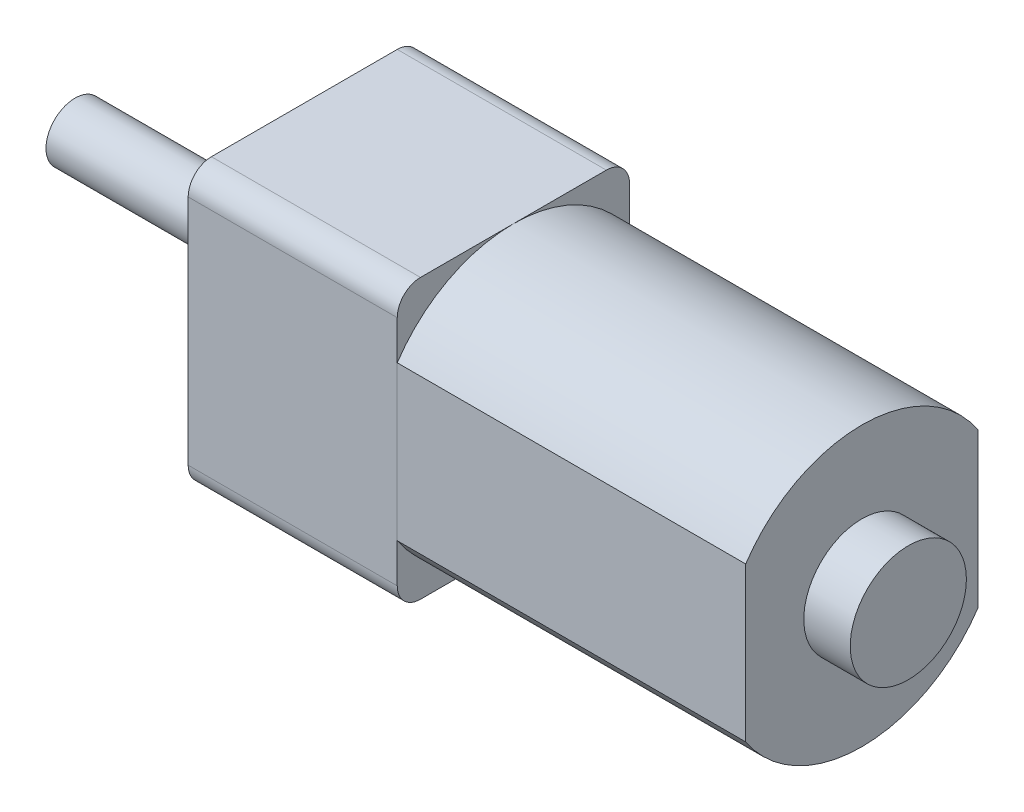
ISO-10303-21;
HEADER;
FILE_DESCRIPTION(('STEP AP214'),'2;1');
FILE_NAME('part.step','',(''),(''),'','','');
FILE_SCHEMA(('AUTOMOTIVE_DESIGN { 1 0 10303 214 1 1 1 1 }'));
ENDSEC;
DATA;
#1=APPLICATION_CONTEXT('core data for automotive mechanical design processes');
#2=APPLICATION_PROTOCOL_DEFINITION('international standard','automotive_design',2000,#1);
#3=PRODUCT_CONTEXT('',#1,'mechanical');
#4=PRODUCT('Part','Part','',(#3));
#5=PRODUCT_RELATED_PRODUCT_CATEGORY('part','',(#4));
#6=PRODUCT_DEFINITION_FORMATION('','',#4);
#7=PRODUCT_DEFINITION_CONTEXT('part definition',#1,'design');
#8=PRODUCT_DEFINITION('design','',#6,#7);
#9=PRODUCT_DEFINITION_SHAPE('','',#8);
#10=(LENGTH_UNIT() NAMED_UNIT(*) SI_UNIT(.MILLI.,.METRE.));
#11=(NAMED_UNIT(*) PLANE_ANGLE_UNIT() SI_UNIT($,.RADIAN.));
#12=(NAMED_UNIT(*) SI_UNIT($,.STERADIAN.) SOLID_ANGLE_UNIT());
#13=UNCERTAINTY_MEASURE_WITH_UNIT(LENGTH_MEASURE(1.E-05),#10,'distance_accuracy_value','');
#14=(GEOMETRIC_REPRESENTATION_CONTEXT(3) GLOBAL_UNCERTAINTY_ASSIGNED_CONTEXT((#13)) GLOBAL_UNIT_ASSIGNED_CONTEXT((#10,
#11,#12)) REPRESENTATION_CONTEXT('',''));
#15=CARTESIAN_POINT('',(0.,0.,0.));
#16=DIRECTION('',(0.,0.,1.));
#17=DIRECTION('',(1.,0.,0.));
#18=AXIS2_PLACEMENT_3D('',#15,#16,#17);
#19=CARTESIAN_POINT('',(-24.6,0.,0.));
#20=DIRECTION('',(-1.,0.,0.));
#21=DIRECTION('',(0.,0.,1.));
#22=AXIS2_PLACEMENT_3D('',#19,#20,#21);
#23=PLANE('',#22);
#24=CARTESIAN_POINT('',(-24.6,0.,0.));
#25=DIRECTION('',(-1.,0.,0.));
#26=DIRECTION('',(0.,0.,1.));
#27=AXIS2_PLACEMENT_3D('',#24,#25,#26);
#28=CIRCLE('',#27,1.95);
#29=CARTESIAN_POINT('',(-24.6,0.,1.95000000000001));
#30=VERTEX_POINT('',#29);
#31=EDGE_CURVE('E11',#30,#30,#28,.T.);
#32=ORIENTED_EDGE('',*,*,#31,.T.);
#33=EDGE_LOOP('',(#32));
#34=FACE_BOUND('',#33,.T.);
#35=CARTESIAN_POINT('',(-24.6,0.,0.));
#36=DIRECTION('',(-1.,0.,0.));
#37=DIRECTION('',(0.,0.,1.));
#38=AXIS2_PLACEMENT_3D('',#35,#36,#37);
#39=CIRCLE('',#38,1.25);
#40=CARTESIAN_POINT('',(-24.6,0.,1.25000000000001));
#41=VERTEX_POINT('',#40);
#42=EDGE_CURVE('E56',#41,#41,#39,.T.);
#43=ORIENTED_EDGE('',*,*,#42,.F.);
#44=EDGE_LOOP('',(#43));
#45=FACE_BOUND('',#44,.T.);
#46=ADVANCED_FACE('F43',(#34,#45),#23,.T.);
#47=CARTESIAN_POINT('',(-24.6,0.,0.));
#48=DIRECTION('',(1.,0.,0.));
#49=DIRECTION('',(0.,0.,-1.));
#50=AXIS2_PLACEMENT_3D('',#47,#48,#49);
#51=CYLINDRICAL_SURFACE('',#50,1.95);
#52=ORIENTED_EDGE('',*,*,#31,.F.);
#53=EDGE_LOOP('',(#52));
#54=FACE_BOUND('',#53,.T.);
#55=CARTESIAN_POINT('',(-24.,0.,0.));
#56=DIRECTION('',(-1.,0.,0.));
#57=DIRECTION('',(0.,0.,1.));
#58=AXIS2_PLACEMENT_3D('',#55,#56,#57);
#59=CIRCLE('',#58,1.95);
#60=CARTESIAN_POINT('',(-24.,0.,1.95));
#61=VERTEX_POINT('',#60);
#62=EDGE_CURVE('E47',#61,#61,#59,.T.);
#63=ORIENTED_EDGE('',*,*,#62,.T.);
#64=EDGE_LOOP('',(#63));
#65=FACE_BOUND('',#64,.T.);
#66=ADVANCED_FACE('F45',(#54,#65),#51,.T.);
#67=CARTESIAN_POINT('',(-24.,0.,0.));
#68=DIRECTION('',(-1.,0.,0.));
#69=DIRECTION('',(0.,0.,1.));
#70=AXIS2_PLACEMENT_3D('',#67,#68,#69);
#71=PLANE('',#70);
#72=ORIENTED_EDGE('',*,*,#62,.F.);
#73=EDGE_LOOP('',(#72));
#74=FACE_BOUND('',#73,.T.);
#75=ADVANCED_FACE('F67',(#74),#71,.F.);
#76=CARTESIAN_POINT('',(-33.87,0.,0.));
#77=DIRECTION('',(1.,0.,0.));
#78=DIRECTION('',(0.,0.,-1.));
#79=AXIS2_PLACEMENT_3D('',#76,#77,#78);
#80=CYLINDRICAL_SURFACE('',#79,1.25);
#81=CARTESIAN_POINT('',(-33.87,0.,0.));
#82=DIRECTION('',(-1.,0.,0.));
#83=DIRECTION('',(0.,0.,1.));
#84=AXIS2_PLACEMENT_3D('',#81,#82,#83);
#85=CIRCLE('',#84,1.25);
#86=CARTESIAN_POINT('',(-33.87,0.,1.25000000000001));
#87=VERTEX_POINT('',#86);
#88=EDGE_CURVE('E54',#87,#87,#85,.T.);
#89=ORIENTED_EDGE('',*,*,#88,.F.);
#90=EDGE_LOOP('',(#89));
#91=FACE_BOUND('',#90,.T.);
#92=ORIENTED_EDGE('',*,*,#42,.T.);
#93=EDGE_LOOP('',(#92));
#94=FACE_BOUND('',#93,.T.);
#95=ADVANCED_FACE('F64',(#91,#94),#80,.T.);
#96=CARTESIAN_POINT('',(-33.87,0.,0.));
#97=DIRECTION('',(-1.,0.,0.));
#98=DIRECTION('',(0.,0.,1.));
#99=AXIS2_PLACEMENT_3D('',#96,#97,#98);
#100=PLANE('',#99);
#101=ORIENTED_EDGE('',*,*,#88,.T.);
#102=EDGE_LOOP('',(#101));
#103=FACE_BOUND('',#102,.T.);
#104=ADVANCED_FACE('F62',(#103),#100,.T.);
#105=CLOSED_SHELL('',(#46,#66,#75,#95,#104));
#106=MANIFOLD_SOLID_BREP('B2',#105);
#107=CARTESIAN_POINT('',(2.00000000000001,0.,0.));
#108=DIRECTION('',(-1.,0.,0.));
#109=DIRECTION('',(0.,0.,1.));
#110=AXIS2_PLACEMENT_3D('',#107,#108,#109);
#111=CYLINDRICAL_SURFACE('',#110,2.5);
#112=CARTESIAN_POINT('',(2.00000000000001,0.,0.));
#113=DIRECTION('',(1.,0.,0.));
#114=DIRECTION('',(0.,0.,-1.));
#115=AXIS2_PLACEMENT_3D('',#112,#113,#114);
#116=CIRCLE('',#115,2.5);
#117=CARTESIAN_POINT('',(2.00000000000001,0.,-2.50000000000001));
#118=VERTEX_POINT('',#117);
#119=EDGE_CURVE('E42',#118,#118,#116,.T.);
#120=ORIENTED_EDGE('',*,*,#119,.F.);
#121=EDGE_LOOP('',(#120));
#122=FACE_BOUND('',#121,.T.);
#123=CARTESIAN_POINT('',(0.,0.,0.));
#124=DIRECTION('',(1.,0.,0.));
#125=DIRECTION('',(0.,0.,-1.));
#126=AXIS2_PLACEMENT_3D('',#123,#124,#125);
#127=CIRCLE('',#126,2.5);
#128=CARTESIAN_POINT('',(0.,0.,-2.50000000000001));
#129=VERTEX_POINT('',#128);
#130=EDGE_CURVE('E126',#129,#129,#127,.T.);
#131=ORIENTED_EDGE('',*,*,#130,.T.);
#132=EDGE_LOOP('',(#131));
#133=FACE_BOUND('',#132,.T.);
#134=ADVANCED_FACE('F123',(#122,#133),#111,.T.);
#135=CARTESIAN_POINT('',(2.00000000000001,0.,0.));
#136=DIRECTION('',(1.,0.,0.));
#137=DIRECTION('',(0.,0.,-1.));
#138=AXIS2_PLACEMENT_3D('',#135,#136,#137);
#139=PLANE('',#138);
#140=ORIENTED_EDGE('',*,*,#119,.T.);
#141=EDGE_LOOP('',(#140));
#142=FACE_BOUND('',#141,.T.);
#143=ADVANCED_FACE('F138',(#142),#139,.T.);
#144=CARTESIAN_POINT('',(0.,0.,0.));
#145=DIRECTION('',(1.,0.,0.));
#146=DIRECTION('',(0.,0.,-1.));
#147=AXIS2_PLACEMENT_3D('',#144,#145,#146);
#148=PLANE('',#147);
#149=ORIENTED_EDGE('',*,*,#130,.F.);
#150=EDGE_LOOP('',(#149));
#151=FACE_BOUND('',#150,.T.);
#152=ADVANCED_FACE('F136',(#151),#148,.F.);
#153=CLOSED_SHELL('',(#134,#143,#152));
#154=MANIFOLD_SOLID_BREP('B6',#153);
#155=CARTESIAN_POINT('',(-24.,6.00000000000001,5.));
#156=DIRECTION('',(1.,0.,0.));
#157=DIRECTION('',(0.,0.,-1.));
#158=AXIS2_PLACEMENT_3D('',#155,#156,#157);
#159=PLANE('',#158);
#160=DIRECTION('',(0.,-1.,0.));
#161=VECTOR('',#160,1.);
#162=CARTESIAN_POINT('',(-24.,-6.00000000000009,-5.00000000000001));
#163=LINE('',#162,#161);
#164=CARTESIAN_POINT('',(-24.,5.00000000000003,-5.00000000000002));
#165=VERTEX_POINT('',#164);
#166=CARTESIAN_POINT('',(-24.,-5.00000000000009,-5.00000000000002));
#167=VERTEX_POINT('',#166);
#168=EDGE_CURVE('E303',#165,#167,#163,.T.);
#169=ORIENTED_EDGE('',*,*,#168,.T.);
#170=CARTESIAN_POINT('',(-24.,-5.00000000000009,-4.00000000000001));
#171=DIRECTION('',(1.,0.,0.));
#172=DIRECTION('',(0.,0.,-1.));
#173=AXIS2_PLACEMENT_3D('',#170,#171,#172);
#174=CIRCLE('',#173,1.);
#175=CARTESIAN_POINT('',(-24.,-6.00000000000009,-4.00000000000001));
#176=VERTEX_POINT('',#175);
#177=EDGE_CURVE('E286',#167,#176,#174,.F.);
#178=ORIENTED_EDGE('',*,*,#177,.T.);
#179=DIRECTION('',(0.,0.,1.));
#180=VECTOR('',#179,1.);
#181=CARTESIAN_POINT('',(-24.,-6.00000000000009,-5.00000000000001));
#182=LINE('',#181,#180);
#183=CARTESIAN_POINT('',(-24.,-6.00000000000004,4.00000000000002));
#184=VERTEX_POINT('',#183);
#185=EDGE_CURVE('E257',#176,#184,#182,.T.);
#186=ORIENTED_EDGE('',*,*,#185,.T.);
#187=CARTESIAN_POINT('',(-24.,-5.00000000000004,4.00000000000002));
#188=DIRECTION('',(1.,0.,0.));
#189=DIRECTION('',(0.,0.,-1.));
#190=AXIS2_PLACEMENT_3D('',#187,#188,#189);
#191=CIRCLE('',#190,1.);
#192=CARTESIAN_POINT('',(-24.,-5.00000000000004,5.00000000000002));
#193=VERTEX_POINT('',#192);
#194=EDGE_CURVE('E284',#184,#193,#191,.F.);
#195=ORIENTED_EDGE('',*,*,#194,.T.);
#196=DIRECTION('',(0.,1.,0.));
#197=VECTOR('',#196,1.);
#198=CARTESIAN_POINT('',(-24.,-6.00000000000004,5.00000000000002));
#199=LINE('',#198,#197);
#200=CARTESIAN_POINT('',(-24.,4.99999999999999,5.));
#201=VERTEX_POINT('',#200);
#202=EDGE_CURVE('E264',#193,#201,#199,.T.);
#203=ORIENTED_EDGE('',*,*,#202,.T.);
#204=CARTESIAN_POINT('',(-24.,4.99999999999999,4.));
#205=DIRECTION('',(1.,0.,0.));
#206=DIRECTION('',(0.,0.,-1.));
#207=AXIS2_PLACEMENT_3D('',#204,#205,#206);
#208=CIRCLE('',#207,1.);
#209=CARTESIAN_POINT('',(-24.,6.00000000000001,4.));
#210=VERTEX_POINT('',#209);
#211=EDGE_CURVE('E192',#201,#210,#208,.F.);
#212=ORIENTED_EDGE('',*,*,#211,.T.);
#213=DIRECTION('',(0.,0.,-1.));
#214=VECTOR('',#213,1.);
#215=CARTESIAN_POINT('',(-24.,6.00000000000003,-5.00000000000002));
#216=LINE('',#215,#214);
#217=CARTESIAN_POINT('',(-24.,6.00000000000003,-4.00000000000002));
#218=VERTEX_POINT('',#217);
#219=EDGE_CURVE('E267',#210,#218,#216,.T.);
#220=ORIENTED_EDGE('',*,*,#219,.T.);
#221=CARTESIAN_POINT('',(-24.,5.00000000000003,-4.00000000000001));
#222=DIRECTION('',(1.,0.,0.));
#223=DIRECTION('',(0.,0.,-1.));
#224=AXIS2_PLACEMENT_3D('',#221,#222,#223);
#225=CIRCLE('',#224,1.);
#226=EDGE_CURVE('E282',#218,#165,#225,.F.);
#227=ORIENTED_EDGE('',*,*,#226,.T.);
#228=EDGE_LOOP('',(#169,#178,#186,#195,#203,#212,#220,#227));
#229=FACE_BOUND('',#228,.T.);
#230=CARTESIAN_POINT('',(-24.,0.,0.));
#231=DIRECTION('',(-1.,0.,0.));
#232=DIRECTION('',(0.,0.,1.));
#233=AXIS2_PLACEMENT_3D('',#230,#231,#232);
#234=CIRCLE('',#233,1.40454739751599);
#235=CARTESIAN_POINT('',(-24.,0.,1.40454739751599));
#236=VERTEX_POINT('',#235);
#237=EDGE_CURVE('E299',#236,#236,#234,.T.);
#238=ORIENTED_EDGE('',*,*,#237,.F.);
#239=EDGE_LOOP('',(#238));
#240=FACE_BOUND('',#239,.T.);
#241=ADVANCED_FACE('F172',(#229,#240),#159,.F.);
#242=CARTESIAN_POINT('',(-15.,5.99999999999996,5.00000000000002));
#243=DIRECTION('',(1.,0.,0.));
#244=DIRECTION('',(0.,0.,-1.));
#245=AXIS2_PLACEMENT_3D('',#242,#243,#244);
#246=PLANE('',#245);
#247=DIRECTION('',(0.,0.,1.));
#248=VECTOR('',#247,1.);
#249=CARTESIAN_POINT('',(-15.,-6.00000000000012,-5.00000000000002));
#250=LINE('',#249,#248);
#251=CARTESIAN_POINT('',(-15.,-6.00000000000012,-4.00000000000001));
#252=VERTEX_POINT('',#251);
#253=CARTESIAN_POINT('',(-15.,-6.00000000000008,4.00000000000002));
#254=VERTEX_POINT('',#253);
#255=EDGE_CURVE('E254',#252,#254,#250,.T.);
#256=ORIENTED_EDGE('',*,*,#255,.F.);
#257=CARTESIAN_POINT('',(-15.,-5.00000000000008,-4.00000000000001));
#258=DIRECTION('',(1.,0.,0.));
#259=DIRECTION('',(0.,0.,-1.));
#260=AXIS2_PLACEMENT_3D('',#257,#258,#259);
#261=CIRCLE('',#260,1.);
#262=CARTESIAN_POINT('',(-15.,-5.00000000000008,-5.00000000000003));
#263=VERTEX_POINT('',#262);
#264=EDGE_CURVE('E237',#252,#263,#261,.T.);
#265=ORIENTED_EDGE('',*,*,#264,.T.);
#266=DIRECTION('',(0.,-1.,0.));
#267=VECTOR('',#266,1.);
#268=CARTESIAN_POINT('',(-15.,-6.00000000000012,-5.00000000000002));
#269=LINE('',#268,#267);
#270=CARTESIAN_POINT('',(-15.,4.99999999999992,-5.00000000000003));
#271=VERTEX_POINT('',#270);
#272=EDGE_CURVE('E265',#271,#263,#269,.T.);
#273=ORIENTED_EDGE('',*,*,#272,.F.);
#274=CARTESIAN_POINT('',(-15.,4.99999999999992,-4.00000000000001));
#275=DIRECTION('',(1.,0.,0.));
#276=DIRECTION('',(0.,0.,-1.));
#277=AXIS2_PLACEMENT_3D('',#274,#275,#276);
#278=CIRCLE('',#277,1.);
#279=CARTESIAN_POINT('',(-15.,5.99999999999996,-4.00000000000002));
#280=VERTEX_POINT('',#279);
#281=EDGE_CURVE('E275',#271,#280,#278,.T.);
#282=ORIENTED_EDGE('',*,*,#281,.T.);
#283=DIRECTION('',(0.,0.,-1.));
#284=VECTOR('',#283,1.);
#285=CARTESIAN_POINT('',(-15.,5.99999999999996,-5.00000000000003));
#286=LINE('',#285,#284);
#287=CARTESIAN_POINT('',(-15.,5.99999999999996,4.));
#288=VERTEX_POINT('',#287);
#289=EDGE_CURVE('E269',#288,#280,#286,.T.);
#290=ORIENTED_EDGE('',*,*,#289,.F.);
#291=CARTESIAN_POINT('',(-15.,4.99999999999996,4.));
#292=DIRECTION('',(1.,0.,0.));
#293=DIRECTION('',(0.,0.,-1.));
#294=AXIS2_PLACEMENT_3D('',#291,#292,#293);
#295=CIRCLE('',#294,1.);
#296=CARTESIAN_POINT('',(-15.,4.99999999999996,5.00000000000002));
#297=VERTEX_POINT('',#296);
#298=EDGE_CURVE('E258',#288,#297,#295,.T.);
#299=ORIENTED_EDGE('',*,*,#298,.T.);
#300=DIRECTION('',(0.,1.,0.));
#301=VECTOR('',#300,1.);
#302=CARTESIAN_POINT('',(-15.,-6.00000000000008,5.00000000000004));
#303=LINE('',#302,#301);
#304=CARTESIAN_POINT('',(-15.,-5.00000000000008,5.00000000000004));
#305=VERTEX_POINT('',#304);
#306=EDGE_CURVE('E298',#305,#297,#303,.T.);
#307=ORIENTED_EDGE('',*,*,#306,.F.);
#308=CARTESIAN_POINT('',(-15.,-5.00000000000008,4.00000000000002));
#309=DIRECTION('',(1.,0.,0.));
#310=DIRECTION('',(0.,0.,-1.));
#311=AXIS2_PLACEMENT_3D('',#308,#309,#310);
#312=CIRCLE('',#311,1.);
#313=EDGE_CURVE('E248',#305,#254,#312,.T.);
#314=ORIENTED_EDGE('',*,*,#313,.T.);
#315=EDGE_LOOP('',(#256,#265,#273,#282,#290,#299,#307,#314));
#316=FACE_BOUND('',#315,.T.);
#317=CARTESIAN_POINT('',(-15.,0.,0.));
#318=DIRECTION('',(-1.,0.,0.));
#319=DIRECTION('',(0.,0.,1.));
#320=AXIS2_PLACEMENT_3D('',#317,#318,#319);
#321=CIRCLE('',#320,1.40454739751599);
#322=CARTESIAN_POINT('',(-15.,0.,1.40454739751599));
#323=VERTEX_POINT('',#322);
#324=EDGE_CURVE('E307',#323,#323,#321,.T.);
#325=ORIENTED_EDGE('',*,*,#324,.T.);
#326=EDGE_LOOP('',(#325));
#327=FACE_BOUND('',#326,.T.);
#328=ADVANCED_FACE('F261',(#316,#327),#246,.T.);
#329=CARTESIAN_POINT('',(-24.,-6.00000000000004,5.00000000000002));
#330=DIRECTION('',(0.,0.,-1.));
#331=DIRECTION('',(-1.,0.,0.));
#332=AXIS2_PLACEMENT_3D('',#329,#330,#331);
#333=PLANE('',#332);
#334=ORIENTED_EDGE('',*,*,#202,.F.);
#335=DIRECTION('',(1.,0.,0.));
#336=VECTOR('',#335,1.);
#337=CARTESIAN_POINT('',(-24.,-5.00000000000004,5.00000000000002));
#338=LINE('',#337,#336);
#339=EDGE_CURVE('E290',#193,#305,#338,.T.);
#340=ORIENTED_EDGE('',*,*,#339,.T.);
#341=ORIENTED_EDGE('',*,*,#306,.T.);
#342=DIRECTION('',(1.,0.,0.));
#343=VECTOR('',#342,1.);
#344=CARTESIAN_POINT('',(-24.,4.99999999999999,5.));
#345=LINE('',#344,#343);
#346=EDGE_CURVE('E288',#297,#201,#345,.F.);
#347=ORIENTED_EDGE('',*,*,#346,.T.);
#348=EDGE_LOOP('',(#334,#340,#341,#347));
#349=FACE_BOUND('',#348,.T.);
#350=ADVANCED_FACE('F321',(#349),#333,.F.);
#351=CARTESIAN_POINT('',(-24.,6.00000000000003,-5.00000000000002));
#352=DIRECTION('',(0.,-1.,0.));
#353=DIRECTION('',(0.,0.,-1.));
#354=AXIS2_PLACEMENT_3D('',#351,#352,#353);
#355=PLANE('',#354);
#356=ORIENTED_EDGE('',*,*,#289,.T.);
#357=DIRECTION('',(1.,0.,0.));
#358=VECTOR('',#357,1.);
#359=CARTESIAN_POINT('',(-24.,6.00000000000003,-4.00000000000002));
#360=LINE('',#359,#358);
#361=EDGE_CURVE('E121',#280,#218,#360,.F.);
#362=ORIENTED_EDGE('',*,*,#361,.T.);
#363=ORIENTED_EDGE('',*,*,#219,.F.);
#364=DIRECTION('',(1.,0.,0.));
#365=VECTOR('',#364,1.);
#366=CARTESIAN_POINT('',(-24.,6.00000000000001,4.));
#367=LINE('',#366,#365);
#368=EDGE_CURVE('E180',#210,#288,#367,.T.);
#369=ORIENTED_EDGE('',*,*,#368,.T.);
#370=EDGE_LOOP('',(#356,#362,#363,#369));
#371=FACE_BOUND('',#370,.T.);
#372=ADVANCED_FACE('F295',(#371),#355,.F.);
#373=CARTESIAN_POINT('',(-24.,-6.00000000000009,-5.00000000000001));
#374=DIRECTION('',(0.,0.,1.));
#375=DIRECTION('',(1.,0.,0.));
#376=AXIS2_PLACEMENT_3D('',#373,#374,#375);
#377=PLANE('',#376);
#378=ORIENTED_EDGE('',*,*,#272,.T.);
#379=DIRECTION('',(1.,0.,0.));
#380=VECTOR('',#379,1.);
#381=CARTESIAN_POINT('',(-24.,-5.00000000000009,-5.00000000000002));
#382=LINE('',#381,#380);
#383=EDGE_CURVE('E242',#263,#167,#382,.F.);
#384=ORIENTED_EDGE('',*,*,#383,.T.);
#385=ORIENTED_EDGE('',*,*,#168,.F.);
#386=DIRECTION('',(1.,0.,0.));
#387=VECTOR('',#386,1.);
#388=CARTESIAN_POINT('',(-24.,5.00000000000003,-5.00000000000002));
#389=LINE('',#388,#387);
#390=EDGE_CURVE('E247',#165,#271,#389,.T.);
#391=ORIENTED_EDGE('',*,*,#390,.T.);
#392=EDGE_LOOP('',(#378,#384,#385,#391));
#393=FACE_BOUND('',#392,.T.);
#394=ADVANCED_FACE('F327',(#393),#377,.F.);
#395=CARTESIAN_POINT('',(-24.,-6.00000000000009,-5.00000000000001));
#396=DIRECTION('',(0.,1.,0.));
#397=DIRECTION('',(0.,0.,1.));
#398=AXIS2_PLACEMENT_3D('',#395,#396,#397);
#399=PLANE('',#398);
#400=ORIENTED_EDGE('',*,*,#185,.F.);
#401=DIRECTION('',(1.,0.,0.));
#402=VECTOR('',#401,1.);
#403=CARTESIAN_POINT('',(-24.,-6.00000000000009,-4.00000000000001));
#404=LINE('',#403,#402);
#405=EDGE_CURVE('E241',#176,#252,#404,.T.);
#406=ORIENTED_EDGE('',*,*,#405,.T.);
#407=ORIENTED_EDGE('',*,*,#255,.T.);
#408=DIRECTION('',(1.,0.,0.));
#409=VECTOR('',#408,1.);
#410=CARTESIAN_POINT('',(-24.,-6.00000000000004,4.00000000000002));
#411=LINE('',#410,#409);
#412=EDGE_CURVE('E259',#254,#184,#411,.F.);
#413=ORIENTED_EDGE('',*,*,#412,.T.);
#414=EDGE_LOOP('',(#400,#406,#407,#413));
#415=FACE_BOUND('',#414,.T.);
#416=ADVANCED_FACE('F253',(#415),#399,.F.);
#417=CARTESIAN_POINT('',(-24.,0.,0.));
#418=DIRECTION('',(1.,0.,0.));
#419=DIRECTION('',(0.,0.,-1.));
#420=AXIS2_PLACEMENT_3D('',#417,#418,#419);
#421=CYLINDRICAL_SURFACE('',#420,1.40454739751599);
#422=ORIENTED_EDGE('',*,*,#237,.T.);
#423=EDGE_LOOP('',(#422));
#424=FACE_BOUND('',#423,.T.);
#425=ORIENTED_EDGE('',*,*,#324,.F.);
#426=EDGE_LOOP('',(#425));
#427=FACE_BOUND('',#426,.T.);
#428=ADVANCED_FACE('F313',(#424,#427),#421,.F.);
#429=CARTESIAN_POINT('',(-24.,-5.00000000000009,-4.00000000000001));
#430=DIRECTION('',(1.,0.,0.));
#431=DIRECTION('',(0.,0.,-1.));
#432=AXIS2_PLACEMENT_3D('',#429,#430,#431);
#433=CYLINDRICAL_SURFACE('',#432,1.);
#434=ORIENTED_EDGE('',*,*,#177,.F.);
#435=ORIENTED_EDGE('',*,*,#383,.F.);
#436=ORIENTED_EDGE('',*,*,#264,.F.);
#437=ORIENTED_EDGE('',*,*,#405,.F.);
#438=EDGE_LOOP('',(#434,#435,#436,#437));
#439=FACE_BOUND('',#438,.T.);
#440=ADVANCED_FACE('F240',(#439),#433,.T.);
#441=CARTESIAN_POINT('',(-24.,-5.00000000000004,4.00000000000002));
#442=DIRECTION('',(1.,0.,0.));
#443=DIRECTION('',(0.,0.,-1.));
#444=AXIS2_PLACEMENT_3D('',#441,#442,#443);
#445=CYLINDRICAL_SURFACE('',#444,1.);
#446=ORIENTED_EDGE('',*,*,#194,.F.);
#447=ORIENTED_EDGE('',*,*,#412,.F.);
#448=ORIENTED_EDGE('',*,*,#313,.F.);
#449=ORIENTED_EDGE('',*,*,#339,.F.);
#450=EDGE_LOOP('',(#446,#447,#448,#449));
#451=FACE_BOUND('',#450,.T.);
#452=ADVANCED_FACE('F338',(#451),#445,.T.);
#453=CARTESIAN_POINT('',(-24.,5.00000000000003,-4.00000000000001));
#454=DIRECTION('',(1.,0.,0.));
#455=DIRECTION('',(0.,0.,-1.));
#456=AXIS2_PLACEMENT_3D('',#453,#454,#455);
#457=CYLINDRICAL_SURFACE('',#456,1.);
#458=ORIENTED_EDGE('',*,*,#226,.F.);
#459=ORIENTED_EDGE('',*,*,#361,.F.);
#460=ORIENTED_EDGE('',*,*,#281,.F.);
#461=ORIENTED_EDGE('',*,*,#390,.F.);
#462=EDGE_LOOP('',(#458,#459,#460,#461));
#463=FACE_BOUND('',#462,.T.);
#464=ADVANCED_FACE('F340',(#463),#457,.T.);
#465=CARTESIAN_POINT('',(-24.,4.99999999999999,4.));
#466=DIRECTION('',(1.,0.,0.));
#467=DIRECTION('',(0.,0.,-1.));
#468=AXIS2_PLACEMENT_3D('',#465,#466,#467);
#469=CYLINDRICAL_SURFACE('',#468,1.);
#470=ORIENTED_EDGE('',*,*,#211,.F.);
#471=ORIENTED_EDGE('',*,*,#346,.F.);
#472=ORIENTED_EDGE('',*,*,#298,.F.);
#473=ORIENTED_EDGE('',*,*,#368,.F.);
#474=EDGE_LOOP('',(#470,#471,#472,#473));
#475=FACE_BOUND('',#474,.T.);
#476=ADVANCED_FACE('F174',(#475),#469,.T.);
#477=CLOSED_SHELL('',(#241,#328,#350,#372,#394,#416,#428,#440,#452,#464,#476));
#478=MANIFOLD_SOLID_BREP('B37',#477);
#479=CARTESIAN_POINT('',(-15.,0.,0.));
#480=DIRECTION('',(1.,0.,0.));
#481=DIRECTION('',(0.,0.,-1.));
#482=AXIS2_PLACEMENT_3D('',#479,#480,#481);
#483=CYLINDRICAL_SURFACE('',#482,6.00000000000001);
#484=CARTESIAN_POINT('',(0.,0.,0.));
#485=DIRECTION('',(1.,0.,0.));
#486=DIRECTION('',(0.,0.,-1.));
#487=AXIS2_PLACEMENT_3D('',#484,#485,#486);
#488=CIRCLE('',#487,6.00000000000001);
#489=CARTESIAN_POINT('',(0.,3.31662479035535,-5.00000000000002));
#490=VERTEX_POINT('',#489);
#491=CARTESIAN_POINT('',(0.,3.3166247903554,5.));
#492=VERTEX_POINT('',#491);
#493=EDGE_CURVE('E484',#490,#492,#488,.T.);
#494=ORIENTED_EDGE('',*,*,#493,.F.);
#495=DIRECTION('',(1.,0.,0.));
#496=VECTOR('',#495,1.);
#497=CARTESIAN_POINT('',(-15.,3.31662479035537,-5.00000000000002));
#498=LINE('',#497,#496);
#499=CARTESIAN_POINT('',(-15.,3.31662479035537,-5.00000000000002));
#500=VERTEX_POINT('',#499);
#501=EDGE_CURVE('E170',#500,#490,#498,.T.);
#502=ORIENTED_EDGE('',*,*,#501,.F.);
#503=CARTESIAN_POINT('',(-15.,0.,0.));
#504=DIRECTION('',(1.,0.,0.));
#505=DIRECTION('',(0.,0.,-1.));
#506=AXIS2_PLACEMENT_3D('',#503,#504,#505);
#507=CIRCLE('',#506,6.00000000000001);
#508=CARTESIAN_POINT('',(-15.,3.31662479035537,5.));
#509=VERTEX_POINT('',#508);
#510=EDGE_CURVE('E478',#500,#509,#507,.T.);
#511=ORIENTED_EDGE('',*,*,#510,.T.);
#512=DIRECTION('',(1.,0.,0.));
#513=VECTOR('',#512,1.);
#514=CARTESIAN_POINT('',(-15.,3.31662479035537,5.));
#515=LINE('',#514,#513);
#516=EDGE_CURVE('E423',#509,#492,#515,.T.);
#517=ORIENTED_EDGE('',*,*,#516,.T.);
#518=EDGE_LOOP('',(#494,#502,#511,#517));
#519=FACE_BOUND('',#518,.T.);
#520=ADVANCED_FACE('F420',(#519),#483,.T.);
#521=CARTESIAN_POINT('',(-15.,3.31662479035537,-5.00000000000002));
#522=DIRECTION('',(0.,0.,-1.));
#523=DIRECTION('',(-1.,0.,0.));
#524=AXIS2_PLACEMENT_3D('',#521,#522,#523);
#525=PLANE('',#524);
#526=DIRECTION('',(0.,1.,0.));
#527=VECTOR('',#526,1.);
#528=CARTESIAN_POINT('',(0.,3.31662479035535,-5.00000000000002));
#529=LINE('',#528,#527);
#530=CARTESIAN_POINT('',(0.,-3.31662479035548,-5.00000000000004));
#531=VERTEX_POINT('',#530);
#532=EDGE_CURVE('E480',#531,#490,#529,.T.);
#533=ORIENTED_EDGE('',*,*,#532,.F.);
#534=DIRECTION('',(1.,0.,0.));
#535=VECTOR('',#534,1.);
#536=CARTESIAN_POINT('',(-15.,-3.31662479035554,-5.00000000000004));
#537=LINE('',#536,#535);
#538=CARTESIAN_POINT('',(-15.,-3.31662479035554,-5.00000000000004));
#539=VERTEX_POINT('',#538);
#540=EDGE_CURVE('E429',#539,#531,#537,.T.);
#541=ORIENTED_EDGE('',*,*,#540,.F.);
#542=DIRECTION('',(0.,1.,0.));
#543=VECTOR('',#542,1.);
#544=CARTESIAN_POINT('',(-15.,3.31662479035537,-5.00000000000002));
#545=LINE('',#544,#543);
#546=EDGE_CURVE('E475',#539,#500,#545,.T.);
#547=ORIENTED_EDGE('',*,*,#546,.T.);
#548=ORIENTED_EDGE('',*,*,#501,.T.);
#549=EDGE_LOOP('',(#533,#541,#547,#548));
#550=FACE_BOUND('',#549,.T.);
#551=ADVANCED_FACE('F494',(#550),#525,.T.);
#552=CARTESIAN_POINT('',(-15.,0.,0.));
#553=DIRECTION('',(1.,0.,0.));
#554=DIRECTION('',(0.,0.,-1.));
#555=AXIS2_PLACEMENT_3D('',#552,#553,#554);
#556=CYLINDRICAL_SURFACE('',#555,6.00000000000001);
#557=CARTESIAN_POINT('',(0.,0.,0.));
#558=DIRECTION('',(1.,0.,0.));
#559=DIRECTION('',(0.,0.,-1.));
#560=AXIS2_PLACEMENT_3D('',#557,#558,#559);
#561=CIRCLE('',#560,6.00000000000001);
#562=CARTESIAN_POINT('',(0.,-3.31662479035549,5.00000000000003));
#563=VERTEX_POINT('',#562);
#564=EDGE_CURVE('E470',#563,#531,#561,.T.);
#565=ORIENTED_EDGE('',*,*,#564,.F.);
#566=DIRECTION('',(1.,0.,0.));
#567=VECTOR('',#566,1.);
#568=CARTESIAN_POINT('',(-15.,-3.31662479035548,5.00000000000004));
#569=LINE('',#568,#567);
#570=CARTESIAN_POINT('',(-15.,-3.31662479035548,5.00000000000004));
#571=VERTEX_POINT('',#570);
#572=EDGE_CURVE('E465',#571,#563,#569,.T.);
#573=ORIENTED_EDGE('',*,*,#572,.F.);
#574=CARTESIAN_POINT('',(-15.,0.,0.));
#575=DIRECTION('',(1.,0.,0.));
#576=DIRECTION('',(0.,0.,-1.));
#577=AXIS2_PLACEMENT_3D('',#574,#575,#576);
#578=CIRCLE('',#577,6.00000000000001);
#579=EDGE_CURVE('E468',#571,#539,#578,.T.);
#580=ORIENTED_EDGE('',*,*,#579,.T.);
#581=ORIENTED_EDGE('',*,*,#540,.T.);
#582=EDGE_LOOP('',(#565,#573,#580,#581));
#583=FACE_BOUND('',#582,.T.);
#584=ADVANCED_FACE('F467',(#583),#556,.T.);
#585=CARTESIAN_POINT('',(-15.,3.31662479035537,5.));
#586=DIRECTION('',(0.,0.,1.));
#587=DIRECTION('',(1.,0.,0.));
#588=AXIS2_PLACEMENT_3D('',#585,#586,#587);
#589=PLANE('',#588);
#590=DIRECTION('',(0.,-1.,0.));
#591=VECTOR('',#590,1.);
#592=CARTESIAN_POINT('',(0.,3.3166247903554,5.));
#593=LINE('',#592,#591);
#594=EDGE_CURVE('E487',#492,#563,#593,.T.);
#595=ORIENTED_EDGE('',*,*,#594,.F.);
#596=ORIENTED_EDGE('',*,*,#516,.F.);
#597=DIRECTION('',(0.,-1.,0.));
#598=VECTOR('',#597,1.);
#599=CARTESIAN_POINT('',(-15.,3.31662479035537,5.));
#600=LINE('',#599,#598);
#601=EDGE_CURVE('E474',#509,#571,#600,.T.);
#602=ORIENTED_EDGE('',*,*,#601,.T.);
#603=ORIENTED_EDGE('',*,*,#572,.T.);
#604=EDGE_LOOP('',(#595,#596,#602,#603));
#605=FACE_BOUND('',#604,.T.);
#606=ADVANCED_FACE('F477',(#605),#589,.T.);
#607=CARTESIAN_POINT('',(-15.,0.,0.));
#608=DIRECTION('',(1.,0.,0.));
#609=DIRECTION('',(0.,0.,-1.));
#610=AXIS2_PLACEMENT_3D('',#607,#608,#609);
#611=PLANE('',#610);
#612=ORIENTED_EDGE('',*,*,#510,.F.);
#613=ORIENTED_EDGE('',*,*,#546,.F.);
#614=ORIENTED_EDGE('',*,*,#579,.F.);
#615=ORIENTED_EDGE('',*,*,#601,.F.);
#616=EDGE_LOOP('',(#612,#613,#614,#615));
#617=FACE_BOUND('',#616,.T.);
#618=ADVANCED_FACE('F473',(#617),#611,.F.);
#619=CARTESIAN_POINT('',(0.,0.,0.));
#620=DIRECTION('',(1.,0.,0.));
#621=DIRECTION('',(0.,0.,-1.));
#622=AXIS2_PLACEMENT_3D('',#619,#620,#621);
#623=PLANE('',#622);
#624=ORIENTED_EDGE('',*,*,#493,.T.);
#625=ORIENTED_EDGE('',*,*,#594,.T.);
#626=ORIENTED_EDGE('',*,*,#564,.T.);
#627=ORIENTED_EDGE('',*,*,#532,.T.);
#628=EDGE_LOOP('',(#624,#625,#626,#627));
#629=FACE_BOUND('',#628,.T.);
#630=ADVANCED_FACE('F493',(#629),#623,.T.);
#631=CLOSED_SHELL('',(#520,#551,#584,#606,#618,#630));
#632=MANIFOLD_SOLID_BREP('B115',#631);
#633=ADVANCED_BREP_SHAPE_REPRESENTATION('',(#18,#106,#154,#478,#632),#14);
#634=SHAPE_DEFINITION_REPRESENTATION(#9,#633);
ENDSEC;
END-ISO-10303-21;
